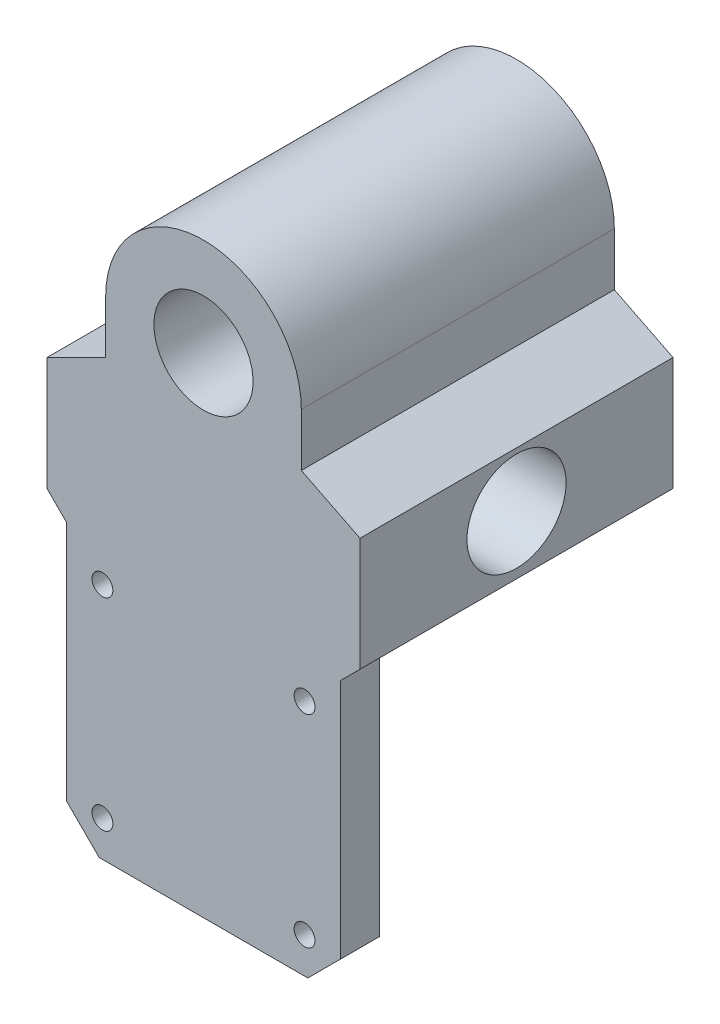
ISO-10303-21;
HEADER;
FILE_DESCRIPTION(('STEP AP214'),'2;1');
FILE_NAME('part.step','',(''),(''),'','','');
FILE_SCHEMA(('AUTOMOTIVE_DESIGN { 1 0 10303 214 1 1 1 1 }'));
ENDSEC;
DATA;
#1=APPLICATION_CONTEXT('core data for automotive mechanical design processes');
#2=APPLICATION_PROTOCOL_DEFINITION('international standard','automotive_design',2000,#1);
#3=PRODUCT_CONTEXT('',#1,'mechanical');
#4=PRODUCT('Part','Part','',(#3));
#5=PRODUCT_RELATED_PRODUCT_CATEGORY('part','',(#4));
#6=PRODUCT_DEFINITION_FORMATION('','',#4);
#7=PRODUCT_DEFINITION_CONTEXT('part definition',#1,'design');
#8=PRODUCT_DEFINITION('design','',#6,#7);
#9=PRODUCT_DEFINITION_SHAPE('','',#8);
#10=(LENGTH_UNIT() NAMED_UNIT(*) SI_UNIT(.MILLI.,.METRE.));
#11=(NAMED_UNIT(*) PLANE_ANGLE_UNIT() SI_UNIT($,.RADIAN.));
#12=(NAMED_UNIT(*) SI_UNIT($,.STERADIAN.) SOLID_ANGLE_UNIT());
#13=UNCERTAINTY_MEASURE_WITH_UNIT(LENGTH_MEASURE(1.E-05),#10,'distance_accuracy_value','');
#14=(GEOMETRIC_REPRESENTATION_CONTEXT(3) GLOBAL_UNCERTAINTY_ASSIGNED_CONTEXT((#13)) GLOBAL_UNIT_ASSIGNED_CONTEXT((#10,
#11,#12)) REPRESENTATION_CONTEXT('',''));
#15=CARTESIAN_POINT('',(0.,0.,0.));
#16=DIRECTION('',(0.,0.,1.));
#17=DIRECTION('',(1.,0.,0.));
#18=AXIS2_PLACEMENT_3D('',#15,#16,#17);
#19=CARTESIAN_POINT('',(-24.,-5.,-24.));
#20=DIRECTION('',(0.,0.,-1.));
#21=DIRECTION('',(-1.,0.,0.));
#22=AXIS2_PLACEMENT_3D('',#19,#20,#21);
#23=PLANE('',#22);
#24=CARTESIAN_POINT('',(0.,28.,-24.));
#25=DIRECTION('',(0.,0.,1.));
#26=DIRECTION('',(1.,0.,0.));
#27=AXIS2_PLACEMENT_3D('',#24,#25,#26);
#28=CIRCLE('',#27,7.6);
#29=CARTESIAN_POINT('',(7.60000000000001,28.,-24.));
#30=VERTEX_POINT('',#29);
#31=EDGE_CURVE('E230',#30,#30,#28,.T.);
#32=ORIENTED_EDGE('',*,*,#31,.T.);
#33=EDGE_LOOP('',(#32));
#34=FACE_BOUND('',#33,.T.);
#35=DIRECTION('',(-1.,0.,0.));
#36=VECTOR('',#35,1.);
#37=CARTESIAN_POINT('',(-24.,-5.,-24.));
#38=LINE('',#37,#36);
#39=CARTESIAN_POINT('',(21.,-5.,-24.));
#40=VERTEX_POINT('',#39);
#41=CARTESIAN_POINT('',(-21.,-5.,-24.));
#42=VERTEX_POINT('',#41);
#43=EDGE_CURVE('E233',#40,#42,#38,.T.);
#44=ORIENTED_EDGE('',*,*,#43,.T.);
#45=DIRECTION('',(0.707106781186549,-0.707106781186546,0.));
#46=VECTOR('',#45,1.);
#47=CARTESIAN_POINT('',(-22.5,-3.49999999999999,-24.));
#48=LINE('',#47,#46);
#49=CARTESIAN_POINT('',(-24.,-2.,-24.));
#50=VERTEX_POINT('',#49);
#51=EDGE_CURVE('E280',#42,#50,#48,.F.);
#52=ORIENTED_EDGE('',*,*,#51,.T.);
#53=DIRECTION('',(0.,1.,0.));
#54=VECTOR('',#53,1.);
#55=CARTESIAN_POINT('',(-24.,-5.,-24.));
#56=LINE('',#55,#54);
#57=CARTESIAN_POINT('',(-24.,15.4,-24.));
#58=VERTEX_POINT('',#57);
#59=EDGE_CURVE('E239',#50,#58,#56,.T.);
#60=ORIENTED_EDGE('',*,*,#59,.T.);
#61=DIRECTION('',(0.894427190999916,0.447213595499958,0.));
#62=VECTOR('',#61,1.);
#63=CARTESIAN_POINT('',(-32.16,11.32,-24.));
#64=LINE('',#63,#62);
#65=CARTESIAN_POINT('',(-15.,19.9,-24.));
#66=VERTEX_POINT('',#65);
#67=EDGE_CURVE('E260',#58,#66,#64,.T.);
#68=ORIENTED_EDGE('',*,*,#67,.T.);
#69=DIRECTION('',(0.,-1.,0.));
#70=VECTOR('',#69,1.);
#71=CARTESIAN_POINT('',(-15.,0.,-24.));
#72=LINE('',#71,#70);
#73=CARTESIAN_POINT('',(-15.,28.,-24.));
#74=VERTEX_POINT('',#73);
#75=EDGE_CURVE('E169',#74,#66,#72,.T.);
#76=ORIENTED_EDGE('',*,*,#75,.F.);
#77=CARTESIAN_POINT('',(0.,28.,-24.));
#78=DIRECTION('',(0.,0.,-1.));
#79=DIRECTION('',(-1.,0.,0.));
#80=AXIS2_PLACEMENT_3D('',#77,#78,#79);
#81=CIRCLE('',#80,15.);
#82=CARTESIAN_POINT('',(15.,28.,-24.));
#83=VERTEX_POINT('',#82);
#84=EDGE_CURVE('E148',#74,#83,#81,.T.);
#85=ORIENTED_EDGE('',*,*,#84,.T.);
#86=DIRECTION('',(0.,-1.,0.));
#87=VECTOR('',#86,1.);
#88=CARTESIAN_POINT('',(15.,0.,-24.));
#89=LINE('',#88,#87);
#90=CARTESIAN_POINT('',(15.,19.9,-24.));
#91=VERTEX_POINT('',#90);
#92=EDGE_CURVE('E167',#83,#91,#89,.T.);
#93=ORIENTED_EDGE('',*,*,#92,.T.);
#94=DIRECTION('',(-0.894427190999916,0.447213595499958,0.));
#95=VECTOR('',#94,1.);
#96=CARTESIAN_POINT('',(-6.24,30.52,-24.));
#97=LINE('',#96,#95);
#98=CARTESIAN_POINT('',(24.,15.4,-24.));
#99=VERTEX_POINT('',#98);
#100=EDGE_CURVE('E241',#91,#99,#97,.F.);
#101=ORIENTED_EDGE('',*,*,#100,.T.);
#102=DIRECTION('',(0.,1.,0.));
#103=VECTOR('',#102,1.);
#104=CARTESIAN_POINT('',(24.,-5.,-24.));
#105=LINE('',#104,#103);
#106=CARTESIAN_POINT('',(24.,-2.,-24.));
#107=VERTEX_POINT('',#106);
#108=EDGE_CURVE('E242',#107,#99,#105,.T.);
#109=ORIENTED_EDGE('',*,*,#108,.F.);
#110=DIRECTION('',(0.707106781186549,0.707106781186546,0.));
#111=VECTOR('',#110,1.);
#112=CARTESIAN_POINT('',(-1.50000000000011,-27.5,-24.));
#113=LINE('',#112,#111);
#114=EDGE_CURVE('E278',#107,#40,#113,.F.);
#115=ORIENTED_EDGE('',*,*,#114,.T.);
#116=EDGE_LOOP('',(#44,#52,#60,#68,#76,#85,#93,#101,#109,#115));
#117=FACE_BOUND('',#116,.T.);
#118=ADVANCED_FACE('F34',(#34,#117),#23,.T.);
#119=CARTESIAN_POINT('',(24.,-5.,24.));
#120=DIRECTION('',(1.,0.,0.));
#121=DIRECTION('',(0.,0.,-1.));
#122=AXIS2_PLACEMENT_3D('',#119,#120,#121);
#123=PLANE('',#122);
#124=CARTESIAN_POINT('',(24.,7.,0.));
#125=DIRECTION('',(1.,0.,0.));
#126=DIRECTION('',(0.,0.,-1.));
#127=AXIS2_PLACEMENT_3D('',#124,#125,#126);
#128=CIRCLE('',#127,7.6);
#129=CARTESIAN_POINT('',(24.,7.,-7.60000000000001));
#130=VERTEX_POINT('',#129);
#131=EDGE_CURVE('E221',#130,#130,#128,.T.);
#132=ORIENTED_EDGE('',*,*,#131,.F.);
#133=EDGE_LOOP('',(#132));
#134=FACE_BOUND('',#133,.T.);
#135=DIRECTION('',(0.,1.,0.));
#136=VECTOR('',#135,1.);
#137=CARTESIAN_POINT('',(24.,-5.,24.));
#138=LINE('',#137,#136);
#139=CARTESIAN_POINT('',(24.,-2.,24.));
#140=VERTEX_POINT('',#139);
#141=CARTESIAN_POINT('',(24.,15.4,24.));
#142=VERTEX_POINT('',#141);
#143=EDGE_CURVE('E244',#140,#142,#138,.T.);
#144=ORIENTED_EDGE('',*,*,#143,.F.);
#145=DIRECTION('',(0.,0.,-1.));
#146=VECTOR('',#145,1.);
#147=CARTESIAN_POINT('',(24.,-2.,24.));
#148=LINE('',#147,#146);
#149=EDGE_CURVE('E282',#140,#107,#148,.T.);
#150=ORIENTED_EDGE('',*,*,#149,.T.);
#151=ORIENTED_EDGE('',*,*,#108,.T.);
#152=DIRECTION('',(0.,0.,1.));
#153=VECTOR('',#152,1.);
#154=CARTESIAN_POINT('',(24.,15.4,24.));
#155=LINE('',#154,#153);
#156=EDGE_CURVE('E249',#99,#142,#155,.T.);
#157=ORIENTED_EDGE('',*,*,#156,.T.);
#158=EDGE_LOOP('',(#144,#150,#151,#157));
#159=FACE_BOUND('',#158,.T.);
#160=ADVANCED_FACE('F323',(#134,#159),#123,.T.);
#161=CARTESIAN_POINT('',(-24.,-5.,24.));
#162=DIRECTION('',(0.,0.,1.));
#163=DIRECTION('',(1.,0.,0.));
#164=AXIS2_PLACEMENT_3D('',#161,#162,#163);
#165=PLANE('',#164);
#166=CARTESIAN_POINT('',(15.5,-41.5,24.));
#167=DIRECTION('',(0.,0.,-1.));
#168=DIRECTION('',(-1.,0.,0.));
#169=AXIS2_PLACEMENT_3D('',#166,#167,#168);
#170=CIRCLE('',#169,1.6);
#171=CARTESIAN_POINT('',(13.9,-41.5,24.));
#172=VERTEX_POINT('',#171);
#173=EDGE_CURVE('E177',#172,#172,#170,.T.);
#174=ORIENTED_EDGE('',*,*,#173,.T.);
#175=EDGE_LOOP('',(#174));
#176=FACE_BOUND('',#175,.T.);
#177=CARTESIAN_POINT('',(-15.5,-41.5,24.));
#178=DIRECTION('',(0.,0.,-1.));
#179=DIRECTION('',(-1.,0.,0.));
#180=AXIS2_PLACEMENT_3D('',#177,#178,#179);
#181=CIRCLE('',#180,1.6);
#182=CARTESIAN_POINT('',(-17.1,-41.5,24.));
#183=VERTEX_POINT('',#182);
#184=EDGE_CURVE('E184',#183,#183,#181,.T.);
#185=ORIENTED_EDGE('',*,*,#184,.T.);
#186=EDGE_LOOP('',(#185));
#187=FACE_BOUND('',#186,.T.);
#188=CARTESIAN_POINT('',(-15.5,-10.5,24.));
#189=DIRECTION('',(0.,0.,-1.));
#190=DIRECTION('',(-1.,0.,0.));
#191=AXIS2_PLACEMENT_3D('',#188,#189,#190);
#192=CIRCLE('',#191,1.6);
#193=CARTESIAN_POINT('',(-17.1,-10.5,24.));
#194=VERTEX_POINT('',#193);
#195=EDGE_CURVE('E190',#194,#194,#192,.T.);
#196=ORIENTED_EDGE('',*,*,#195,.T.);
#197=EDGE_LOOP('',(#196));
#198=FACE_BOUND('',#197,.T.);
#199=CARTESIAN_POINT('',(15.5,-10.5,24.));
#200=DIRECTION('',(0.,0.,-1.));
#201=DIRECTION('',(-1.,0.,0.));
#202=AXIS2_PLACEMENT_3D('',#199,#200,#201);
#203=CIRCLE('',#202,1.6);
#204=CARTESIAN_POINT('',(13.9,-10.5,24.));
#205=VERTEX_POINT('',#204);
#206=EDGE_CURVE('E195',#205,#205,#203,.T.);
#207=ORIENTED_EDGE('',*,*,#206,.T.);
#208=EDGE_LOOP('',(#207));
#209=FACE_BOUND('',#208,.T.);
#210=CARTESIAN_POINT('',(0.,28.,24.));
#211=DIRECTION('',(0.,0.,1.));
#212=DIRECTION('',(1.,0.,0.));
#213=AXIS2_PLACEMENT_3D('',#210,#211,#212);
#214=CIRCLE('',#213,7.6);
#215=CARTESIAN_POINT('',(7.60000000000001,28.,24.));
#216=VERTEX_POINT('',#215);
#217=EDGE_CURVE('E227',#216,#216,#214,.T.);
#218=ORIENTED_EDGE('',*,*,#217,.F.);
#219=EDGE_LOOP('',(#218));
#220=FACE_BOUND('',#219,.T.);
#221=DIRECTION('',(0.,-1.,0.));
#222=VECTOR('',#221,1.);
#223=CARTESIAN_POINT('',(-21.,-5.,24.));
#224=LINE('',#223,#222);
#225=CARTESIAN_POINT('',(-21.,-5.,24.));
#226=VERTEX_POINT('',#225);
#227=CARTESIAN_POINT('',(-21.,-42.,24.));
#228=VERTEX_POINT('',#227);
#229=EDGE_CURVE('E198',#226,#228,#224,.T.);
#230=ORIENTED_EDGE('',*,*,#229,.T.);
#231=DIRECTION('',(-0.707106781186549,0.707106781186546,0.));
#232=VECTOR('',#231,1.);
#233=CARTESIAN_POINT('',(-41.,-22.0000000000001,24.));
#234=LINE('',#233,#232);
#235=CARTESIAN_POINT('',(-16.,-47.,24.));
#236=VERTEX_POINT('',#235);
#237=EDGE_CURVE('E290',#228,#236,#234,.F.);
#238=ORIENTED_EDGE('',*,*,#237,.T.);
#239=DIRECTION('',(1.,0.,0.));
#240=VECTOR('',#239,1.);
#241=CARTESIAN_POINT('',(-21.,-47.,24.));
#242=LINE('',#241,#240);
#243=CARTESIAN_POINT('',(16.,-47.,24.));
#244=VERTEX_POINT('',#243);
#245=EDGE_CURVE('E214',#236,#244,#242,.T.);
#246=ORIENTED_EDGE('',*,*,#245,.T.);
#247=DIRECTION('',(-0.707106781186547,-0.707106781186549,0.));
#248=VECTOR('',#247,1.);
#249=CARTESIAN_POINT('',(17.,-45.9999999999999,24.));
#250=LINE('',#249,#248);
#251=CARTESIAN_POINT('',(21.,-42.,24.));
#252=VERTEX_POINT('',#251);
#253=EDGE_CURVE('E288',#244,#252,#250,.F.);
#254=ORIENTED_EDGE('',*,*,#253,.T.);
#255=DIRECTION('',(0.,1.,0.));
#256=VECTOR('',#255,1.);
#257=CARTESIAN_POINT('',(21.,-5.,24.));
#258=LINE('',#257,#256);
#259=CARTESIAN_POINT('',(21.,-5.,24.));
#260=VERTEX_POINT('',#259);
#261=EDGE_CURVE('E205',#252,#260,#258,.T.);
#262=ORIENTED_EDGE('',*,*,#261,.T.);
#263=DIRECTION('',(-0.707106781186549,-0.707106781186546,0.));
#264=VECTOR('',#263,1.);
#265=CARTESIAN_POINT('',(-1.50000000000011,-27.5,24.));
#266=LINE('',#265,#264);
#267=EDGE_CURVE('E269',#260,#140,#266,.F.);
#268=ORIENTED_EDGE('',*,*,#267,.T.);
#269=ORIENTED_EDGE('',*,*,#143,.T.);
#270=DIRECTION('',(0.894427190999916,-0.447213595499958,0.));
#271=VECTOR('',#270,1.);
#272=CARTESIAN_POINT('',(-6.24,30.52,24.));
#273=LINE('',#272,#271);
#274=CARTESIAN_POINT('',(15.,19.9,24.));
#275=VERTEX_POINT('',#274);
#276=EDGE_CURVE('E252',#142,#275,#273,.F.);
#277=ORIENTED_EDGE('',*,*,#276,.T.);
#278=DIRECTION('',(0.,-1.,0.));
#279=VECTOR('',#278,1.);
#280=CARTESIAN_POINT('',(15.,0.,24.));
#281=LINE('',#280,#279);
#282=CARTESIAN_POINT('',(15.,28.,24.));
#283=VERTEX_POINT('',#282);
#284=EDGE_CURVE('E152',#283,#275,#281,.T.);
#285=ORIENTED_EDGE('',*,*,#284,.F.);
#286=CARTESIAN_POINT('',(0.,28.,24.));
#287=DIRECTION('',(0.,0.,-1.));
#288=DIRECTION('',(-1.,0.,0.));
#289=AXIS2_PLACEMENT_3D('',#286,#287,#288);
#290=CIRCLE('',#289,15.);
#291=CARTESIAN_POINT('',(-15.,28.,24.));
#292=VERTEX_POINT('',#291);
#293=EDGE_CURVE('E145',#292,#283,#290,.T.);
#294=ORIENTED_EDGE('',*,*,#293,.F.);
#295=DIRECTION('',(0.,-1.,0.));
#296=VECTOR('',#295,1.);
#297=CARTESIAN_POINT('',(-15.,0.,24.));
#298=LINE('',#297,#296);
#299=CARTESIAN_POINT('',(-15.,19.9,24.));
#300=VERTEX_POINT('',#299);
#301=EDGE_CURVE('E155',#292,#300,#298,.T.);
#302=ORIENTED_EDGE('',*,*,#301,.T.);
#303=DIRECTION('',(-0.894427190999916,-0.447213595499958,0.));
#304=VECTOR('',#303,1.);
#305=CARTESIAN_POINT('',(-32.16,11.32,24.));
#306=LINE('',#305,#304);
#307=CARTESIAN_POINT('',(-24.,15.4,24.));
#308=VERTEX_POINT('',#307);
#309=EDGE_CURVE('E263',#300,#308,#306,.T.);
#310=ORIENTED_EDGE('',*,*,#309,.T.);
#311=DIRECTION('',(0.,1.,0.));
#312=VECTOR('',#311,1.);
#313=CARTESIAN_POINT('',(-24.,-5.,24.));
#314=LINE('',#313,#312);
#315=CARTESIAN_POINT('',(-24.,-2.,24.));
#316=VERTEX_POINT('',#315);
#317=EDGE_CURVE('E238',#316,#308,#314,.T.);
#318=ORIENTED_EDGE('',*,*,#317,.F.);
#319=DIRECTION('',(-0.707106781186549,0.707106781186546,0.));
#320=VECTOR('',#319,1.);
#321=CARTESIAN_POINT('',(-22.5,-3.49999999999999,24.));
#322=LINE('',#321,#320);
#323=EDGE_CURVE('E271',#316,#226,#322,.F.);
#324=ORIENTED_EDGE('',*,*,#323,.T.);
#325=EDGE_LOOP('',(#230,#238,#246,#254,#262,#268,#269,#277,#285,#294,#302,#310,#318,#324));
#326=FACE_BOUND('',#325,.T.);
#327=ADVANCED_FACE('F165',(#176,#187,#198,#209,#220,#326),#165,.T.);
#328=CARTESIAN_POINT('',(-24.,-5.,24.));
#329=DIRECTION('',(-1.,0.,0.));
#330=DIRECTION('',(0.,0.,1.));
#331=AXIS2_PLACEMENT_3D('',#328,#329,#330);
#332=PLANE('',#331);
#333=ORIENTED_EDGE('',*,*,#59,.F.);
#334=DIRECTION('',(0.,0.,1.));
#335=VECTOR('',#334,1.);
#336=CARTESIAN_POINT('',(-24.,-2.,24.));
#337=LINE('',#336,#335);
#338=EDGE_CURVE('E266',#50,#316,#337,.T.);
#339=ORIENTED_EDGE('',*,*,#338,.T.);
#340=ORIENTED_EDGE('',*,*,#317,.T.);
#341=DIRECTION('',(0.,0.,-1.));
#342=VECTOR('',#341,1.);
#343=CARTESIAN_POINT('',(-24.,15.4,-24.));
#344=LINE('',#343,#342);
#345=EDGE_CURVE('E257',#308,#58,#344,.T.);
#346=ORIENTED_EDGE('',*,*,#345,.T.);
#347=EDGE_LOOP('',(#333,#339,#340,#346));
#348=FACE_BOUND('',#347,.T.);
#349=CARTESIAN_POINT('',(-24.,7.,0.));
#350=DIRECTION('',(1.,0.,0.));
#351=DIRECTION('',(0.,0.,-1.));
#352=AXIS2_PLACEMENT_3D('',#349,#350,#351);
#353=CIRCLE('',#352,7.6);
#354=CARTESIAN_POINT('',(-24.,7.,-7.60000000000001));
#355=VERTEX_POINT('',#354);
#356=EDGE_CURVE('E224',#355,#355,#353,.T.);
#357=ORIENTED_EDGE('',*,*,#356,.T.);
#358=EDGE_LOOP('',(#357));
#359=FACE_BOUND('',#358,.T.);
#360=ADVANCED_FACE('F340',(#348,#359),#332,.T.);
#361=CARTESIAN_POINT('',(0.,-5.,0.));
#362=DIRECTION('',(0.,-1.,0.));
#363=DIRECTION('',(0.,0.,-1.));
#364=AXIS2_PLACEMENT_3D('',#361,#362,#363);
#365=PLANE('',#364);
#366=DIRECTION('',(-1.,0.,0.));
#367=VECTOR('',#366,1.);
#368=CARTESIAN_POINT('',(-21.,-5.,18.));
#369=LINE('',#368,#367);
#370=CARTESIAN_POINT('',(21.,-5.,18.));
#371=VERTEX_POINT('',#370);
#372=CARTESIAN_POINT('',(-21.,-5.,18.));
#373=VERTEX_POINT('',#372);
#374=EDGE_CURVE('E209',#371,#373,#369,.T.);
#375=ORIENTED_EDGE('',*,*,#374,.T.);
#376=DIRECTION('',(0.,0.,-1.));
#377=VECTOR('',#376,1.);
#378=CARTESIAN_POINT('',(-21.,-5.,0.));
#379=LINE('',#378,#377);
#380=EDGE_CURVE('E276',#373,#42,#379,.T.);
#381=ORIENTED_EDGE('',*,*,#380,.T.);
#382=ORIENTED_EDGE('',*,*,#43,.F.);
#383=DIRECTION('',(0.,0.,1.));
#384=VECTOR('',#383,1.);
#385=CARTESIAN_POINT('',(21.,-5.,0.));
#386=LINE('',#385,#384);
#387=EDGE_CURVE('E273',#40,#371,#386,.T.);
#388=ORIENTED_EDGE('',*,*,#387,.T.);
#389=EDGE_LOOP('',(#375,#381,#382,#388));
#390=FACE_BOUND('',#389,.T.);
#391=ADVANCED_FACE('F349',(#390),#365,.T.);
#392=CARTESIAN_POINT('',(0.,28.,-24.));
#393=DIRECTION('',(0.,0.,1.));
#394=DIRECTION('',(1.,0.,0.));
#395=AXIS2_PLACEMENT_3D('',#392,#393,#394);
#396=CYLINDRICAL_SURFACE('',#395,7.6);
#397=ORIENTED_EDGE('',*,*,#31,.F.);
#398=EDGE_LOOP('',(#397));
#399=FACE_BOUND('',#398,.T.);
#400=ORIENTED_EDGE('',*,*,#217,.T.);
#401=EDGE_LOOP('',(#400));
#402=FACE_BOUND('',#401,.T.);
#403=ADVANCED_FACE('F351',(#399,#402),#396,.F.);
#404=CARTESIAN_POINT('',(-24.,7.,0.));
#405=DIRECTION('',(1.,0.,0.));
#406=DIRECTION('',(0.,0.,-1.));
#407=AXIS2_PLACEMENT_3D('',#404,#405,#406);
#408=CYLINDRICAL_SURFACE('',#407,7.6);
#409=ORIENTED_EDGE('',*,*,#356,.F.);
#410=EDGE_LOOP('',(#409));
#411=FACE_BOUND('',#410,.T.);
#412=ORIENTED_EDGE('',*,*,#131,.T.);
#413=EDGE_LOOP('',(#412));
#414=FACE_BOUND('',#413,.T.);
#415=ADVANCED_FACE('F357',(#411,#414),#408,.F.);
#416=CARTESIAN_POINT('',(-21.,-5.,18.));
#417=DIRECTION('',(-1.,0.,0.));
#418=DIRECTION('',(0.,-1.,0.));
#419=AXIS2_PLACEMENT_3D('',#416,#417,#418);
#420=PLANE('',#419);
#421=DIRECTION('',(0.,-1.,0.));
#422=VECTOR('',#421,1.);
#423=CARTESIAN_POINT('',(-21.,-5.,18.));
#424=LINE('',#423,#422);
#425=CARTESIAN_POINT('',(-21.,-42.,18.));
#426=VERTEX_POINT('',#425);
#427=EDGE_CURVE('E201',#373,#426,#424,.T.);
#428=ORIENTED_EDGE('',*,*,#427,.T.);
#429=DIRECTION('',(0.,0.,1.));
#430=VECTOR('',#429,1.);
#431=CARTESIAN_POINT('',(-21.,-42.,18.));
#432=LINE('',#431,#430);
#433=EDGE_CURVE('E285',#426,#228,#432,.T.);
#434=ORIENTED_EDGE('',*,*,#433,.T.);
#435=ORIENTED_EDGE('',*,*,#229,.F.);
#436=DIRECTION('',(0.,0.,1.));
#437=VECTOR('',#436,1.);
#438=CARTESIAN_POINT('',(-21.,-5.,18.));
#439=LINE('',#438,#437);
#440=EDGE_CURVE('E218',#373,#226,#439,.T.);
#441=ORIENTED_EDGE('',*,*,#440,.F.);
#442=EDGE_LOOP('',(#428,#434,#435,#441));
#443=FACE_BOUND('',#442,.T.);
#444=ADVANCED_FACE('F305',(#443),#420,.T.);
#445=CARTESIAN_POINT('',(21.,-5.,18.));
#446=DIRECTION('',(1.,0.,0.));
#447=DIRECTION('',(0.,1.,0.));
#448=AXIS2_PLACEMENT_3D('',#445,#446,#447);
#449=PLANE('',#448);
#450=ORIENTED_EDGE('',*,*,#261,.F.);
#451=DIRECTION('',(0.,0.,-1.));
#452=VECTOR('',#451,1.);
#453=CARTESIAN_POINT('',(21.,-42.,18.));
#454=LINE('',#453,#452);
#455=CARTESIAN_POINT('',(21.,-42.,18.));
#456=VERTEX_POINT('',#455);
#457=EDGE_CURVE('E11',#252,#456,#454,.T.);
#458=ORIENTED_EDGE('',*,*,#457,.T.);
#459=DIRECTION('',(0.,1.,0.));
#460=VECTOR('',#459,1.);
#461=CARTESIAN_POINT('',(21.,-5.,18.));
#462=LINE('',#461,#460);
#463=EDGE_CURVE('E207',#456,#371,#462,.T.);
#464=ORIENTED_EDGE('',*,*,#463,.T.);
#465=DIRECTION('',(0.,0.,1.));
#466=VECTOR('',#465,1.);
#467=CARTESIAN_POINT('',(21.,-5.,18.));
#468=LINE('',#467,#466);
#469=EDGE_CURVE('E212',#371,#260,#468,.T.);
#470=ORIENTED_EDGE('',*,*,#469,.T.);
#471=EDGE_LOOP('',(#450,#458,#464,#470));
#472=FACE_BOUND('',#471,.T.);
#473=ADVANCED_FACE('F313',(#472),#449,.T.);
#474=CARTESIAN_POINT('',(-21.,-47.,18.));
#475=DIRECTION('',(0.,-1.,0.));
#476=DIRECTION('',(0.,0.,-1.));
#477=AXIS2_PLACEMENT_3D('',#474,#475,#476);
#478=PLANE('',#477);
#479=ORIENTED_EDGE('',*,*,#245,.F.);
#480=DIRECTION('',(0.,0.,-1.));
#481=VECTOR('',#480,1.);
#482=CARTESIAN_POINT('',(-16.,-47.,18.));
#483=LINE('',#482,#481);
#484=CARTESIAN_POINT('',(-16.,-47.,18.));
#485=VERTEX_POINT('',#484);
#486=EDGE_CURVE('E295',#236,#485,#483,.T.);
#487=ORIENTED_EDGE('',*,*,#486,.T.);
#488=DIRECTION('',(1.,0.,0.));
#489=VECTOR('',#488,1.);
#490=CARTESIAN_POINT('',(-21.,-47.,18.));
#491=LINE('',#490,#489);
#492=CARTESIAN_POINT('',(16.,-47.,18.));
#493=VERTEX_POINT('',#492);
#494=EDGE_CURVE('E204',#485,#493,#491,.T.);
#495=ORIENTED_EDGE('',*,*,#494,.T.);
#496=DIRECTION('',(0.,0.,1.));
#497=VECTOR('',#496,1.);
#498=CARTESIAN_POINT('',(16.,-47.,18.));
#499=LINE('',#498,#497);
#500=EDGE_CURVE('E292',#493,#244,#499,.T.);
#501=ORIENTED_EDGE('',*,*,#500,.T.);
#502=EDGE_LOOP('',(#479,#487,#495,#501));
#503=FACE_BOUND('',#502,.T.);
#504=ADVANCED_FACE('F310',(#503),#478,.T.);
#505=CARTESIAN_POINT('',(0.,0.,18.));
#506=DIRECTION('',(0.,0.,1.));
#507=DIRECTION('',(1.,0.,0.));
#508=AXIS2_PLACEMENT_3D('',#505,#506,#507);
#509=PLANE('',#508);
#510=CARTESIAN_POINT('',(15.5,-41.5,18.));
#511=DIRECTION('',(0.,0.,-1.));
#512=DIRECTION('',(-1.,0.,0.));
#513=AXIS2_PLACEMENT_3D('',#510,#511,#512);
#514=CIRCLE('',#513,1.6);
#515=CARTESIAN_POINT('',(13.9,-41.5,18.));
#516=VERTEX_POINT('',#515);
#517=EDGE_CURVE('E181',#516,#516,#514,.T.);
#518=ORIENTED_EDGE('',*,*,#517,.F.);
#519=EDGE_LOOP('',(#518));
#520=FACE_BOUND('',#519,.T.);
#521=CARTESIAN_POINT('',(-15.5,-41.5,18.));
#522=DIRECTION('',(0.,0.,-1.));
#523=DIRECTION('',(-1.,0.,0.));
#524=AXIS2_PLACEMENT_3D('',#521,#522,#523);
#525=CIRCLE('',#524,1.6);
#526=CARTESIAN_POINT('',(-17.1,-41.5,18.));
#527=VERTEX_POINT('',#526);
#528=EDGE_CURVE('E187',#527,#527,#525,.T.);
#529=ORIENTED_EDGE('',*,*,#528,.F.);
#530=EDGE_LOOP('',(#529));
#531=FACE_BOUND('',#530,.T.);
#532=CARTESIAN_POINT('',(-15.5,-10.5,18.));
#533=DIRECTION('',(0.,0.,-1.));
#534=DIRECTION('',(-1.,0.,0.));
#535=AXIS2_PLACEMENT_3D('',#532,#533,#534);
#536=CIRCLE('',#535,1.6);
#537=CARTESIAN_POINT('',(-17.1,-10.5,18.));
#538=VERTEX_POINT('',#537);
#539=EDGE_CURVE('E175',#538,#538,#536,.T.);
#540=ORIENTED_EDGE('',*,*,#539,.F.);
#541=EDGE_LOOP('',(#540));
#542=FACE_BOUND('',#541,.T.);
#543=CARTESIAN_POINT('',(15.5,-10.5,18.));
#544=DIRECTION('',(0.,0.,-1.));
#545=DIRECTION('',(-1.,0.,0.));
#546=AXIS2_PLACEMENT_3D('',#543,#544,#545);
#547=CIRCLE('',#546,1.6);
#548=CARTESIAN_POINT('',(13.9,-10.5,18.));
#549=VERTEX_POINT('',#548);
#550=EDGE_CURVE('E180',#549,#549,#547,.T.);
#551=ORIENTED_EDGE('',*,*,#550,.F.);
#552=EDGE_LOOP('',(#551));
#553=FACE_BOUND('',#552,.T.);
#554=ORIENTED_EDGE('',*,*,#494,.F.);
#555=DIRECTION('',(0.707106781186549,-0.707106781186546,0.));
#556=VECTOR('',#555,1.);
#557=CARTESIAN_POINT('',(-21.,-42.,18.));
#558=LINE('',#557,#556);
#559=EDGE_CURVE('E42',#485,#426,#558,.F.);
#560=ORIENTED_EDGE('',*,*,#559,.T.);
#561=ORIENTED_EDGE('',*,*,#427,.F.);
#562=ORIENTED_EDGE('',*,*,#374,.F.);
#563=ORIENTED_EDGE('',*,*,#463,.F.);
#564=DIRECTION('',(0.707106781186547,0.707106781186549,0.));
#565=VECTOR('',#564,1.);
#566=CARTESIAN_POINT('',(16.,-47.,18.));
#567=LINE('',#566,#565);
#568=EDGE_CURVE('E54',#456,#493,#567,.F.);
#569=ORIENTED_EDGE('',*,*,#568,.T.);
#570=EDGE_LOOP('',(#554,#560,#561,#562,#563,#569));
#571=FACE_BOUND('',#570,.T.);
#572=ADVANCED_FACE('F299',(#520,#531,#542,#553,#571),#509,.F.);
#573=CARTESIAN_POINT('',(15.5,-10.5,24.));
#574=DIRECTION('',(0.,0.,-1.));
#575=DIRECTION('',(-1.,0.,0.));
#576=AXIS2_PLACEMENT_3D('',#573,#574,#575);
#577=CYLINDRICAL_SURFACE('',#576,1.6);
#578=ORIENTED_EDGE('',*,*,#206,.F.);
#579=EDGE_LOOP('',(#578));
#580=FACE_BOUND('',#579,.T.);
#581=ORIENTED_EDGE('',*,*,#550,.T.);
#582=EDGE_LOOP('',(#581));
#583=FACE_BOUND('',#582,.T.);
#584=ADVANCED_FACE('F400',(#580,#583),#577,.F.);
#585=CARTESIAN_POINT('',(-15.5,-10.5,24.));
#586=DIRECTION('',(0.,0.,-1.));
#587=DIRECTION('',(-1.,0.,0.));
#588=AXIS2_PLACEMENT_3D('',#585,#586,#587);
#589=CYLINDRICAL_SURFACE('',#588,1.6);
#590=ORIENTED_EDGE('',*,*,#195,.F.);
#591=EDGE_LOOP('',(#590));
#592=FACE_BOUND('',#591,.T.);
#593=ORIENTED_EDGE('',*,*,#539,.T.);
#594=EDGE_LOOP('',(#593));
#595=FACE_BOUND('',#594,.T.);
#596=ADVANCED_FACE('F524',(#592,#595),#589,.F.);
#597=CARTESIAN_POINT('',(-15.5,-41.5,24.));
#598=DIRECTION('',(0.,0.,-1.));
#599=DIRECTION('',(-1.,0.,0.));
#600=AXIS2_PLACEMENT_3D('',#597,#598,#599);
#601=CYLINDRICAL_SURFACE('',#600,1.6);
#602=ORIENTED_EDGE('',*,*,#184,.F.);
#603=EDGE_LOOP('',(#602));
#604=FACE_BOUND('',#603,.T.);
#605=ORIENTED_EDGE('',*,*,#528,.T.);
#606=EDGE_LOOP('',(#605));
#607=FACE_BOUND('',#606,.T.);
#608=ADVANCED_FACE('F514',(#604,#607),#601,.F.);
#609=CARTESIAN_POINT('',(15.5,-41.5,24.));
#610=DIRECTION('',(0.,0.,-1.));
#611=DIRECTION('',(-1.,0.,0.));
#612=AXIS2_PLACEMENT_3D('',#609,#610,#611);
#613=CYLINDRICAL_SURFACE('',#612,1.6);
#614=ORIENTED_EDGE('',*,*,#173,.F.);
#615=EDGE_LOOP('',(#614));
#616=FACE_BOUND('',#615,.T.);
#617=ORIENTED_EDGE('',*,*,#517,.T.);
#618=EDGE_LOOP('',(#617));
#619=FACE_BOUND('',#618,.T.);
#620=ADVANCED_FACE('F505',(#616,#619),#613,.F.);
#621=CARTESIAN_POINT('',(0.,28.,24.));
#622=DIRECTION('',(0.,0.,-1.));
#623=DIRECTION('',(-1.,0.,0.));
#624=AXIS2_PLACEMENT_3D('',#621,#622,#623);
#625=CYLINDRICAL_SURFACE('',#624,15.);
#626=ORIENTED_EDGE('',*,*,#84,.F.);
#627=DIRECTION('',(0.,0.,-1.));
#628=VECTOR('',#627,1.);
#629=CARTESIAN_POINT('',(-15.,28.,24.));
#630=LINE('',#629,#628);
#631=EDGE_CURVE('E140',#292,#74,#630,.T.);
#632=ORIENTED_EDGE('',*,*,#631,.F.);
#633=ORIENTED_EDGE('',*,*,#293,.T.);
#634=DIRECTION('',(0.,0.,-1.));
#635=VECTOR('',#634,1.);
#636=CARTESIAN_POINT('',(15.,28.,24.));
#637=LINE('',#636,#635);
#638=EDGE_CURVE('E151',#283,#83,#637,.T.);
#639=ORIENTED_EDGE('',*,*,#638,.T.);
#640=EDGE_LOOP('',(#626,#632,#633,#639));
#641=FACE_BOUND('',#640,.T.);
#642=ADVANCED_FACE('F142',(#641),#625,.T.);
#643=CARTESIAN_POINT('',(15.,0.,24.));
#644=DIRECTION('',(1.,0.,0.));
#645=DIRECTION('',(0.,1.,0.));
#646=AXIS2_PLACEMENT_3D('',#643,#644,#645);
#647=PLANE('',#646);
#648=ORIENTED_EDGE('',*,*,#92,.F.);
#649=ORIENTED_EDGE('',*,*,#638,.F.);
#650=ORIENTED_EDGE('',*,*,#284,.T.);
#651=DIRECTION('',(0.,0.,1.));
#652=VECTOR('',#651,1.);
#653=CARTESIAN_POINT('',(15.,19.9,24.));
#654=LINE('',#653,#652);
#655=EDGE_CURVE('E254',#275,#91,#654,.F.);
#656=ORIENTED_EDGE('',*,*,#655,.T.);
#657=EDGE_LOOP('',(#648,#649,#650,#656));
#658=FACE_BOUND('',#657,.T.);
#659=ADVANCED_FACE('F331',(#658),#647,.T.);
#660=CARTESIAN_POINT('',(-15.,0.,24.));
#661=DIRECTION('',(1.,0.,0.));
#662=DIRECTION('',(0.,1.,0.));
#663=AXIS2_PLACEMENT_3D('',#660,#661,#662);
#664=PLANE('',#663);
#665=ORIENTED_EDGE('',*,*,#75,.T.);
#666=DIRECTION('',(0.,0.,1.));
#667=VECTOR('',#666,1.);
#668=CARTESIAN_POINT('',(-15.,19.9,24.));
#669=LINE('',#668,#667);
#670=EDGE_CURVE('E158',#66,#300,#669,.T.);
#671=ORIENTED_EDGE('',*,*,#670,.T.);
#672=ORIENTED_EDGE('',*,*,#301,.F.);
#673=ORIENTED_EDGE('',*,*,#631,.T.);
#674=EDGE_LOOP('',(#665,#671,#672,#673));
#675=FACE_BOUND('',#674,.T.);
#676=ADVANCED_FACE('F156',(#675),#664,.F.);
#677=CARTESIAN_POINT('',(14.,20.4,24.));
#678=DIRECTION('',(-0.447213595499958,-0.894427190999916,0.));
#679=DIRECTION('',(0.,0.,-1.));
#680=AXIS2_PLACEMENT_3D('',#677,#678,#679);
#681=PLANE('',#680);
#682=ORIENTED_EDGE('',*,*,#276,.F.);
#683=ORIENTED_EDGE('',*,*,#156,.F.);
#684=ORIENTED_EDGE('',*,*,#100,.F.);
#685=ORIENTED_EDGE('',*,*,#655,.F.);
#686=EDGE_LOOP('',(#682,#683,#684,#685));
#687=FACE_BOUND('',#686,.T.);
#688=ADVANCED_FACE('F328',(#687),#681,.F.);
#689=CARTESIAN_POINT('',(-24.,15.4,24.));
#690=DIRECTION('',(-0.447213595499958,0.894427190999916,0.));
#691=DIRECTION('',(0.,0.,1.));
#692=AXIS2_PLACEMENT_3D('',#689,#690,#691);
#693=PLANE('',#692);
#694=ORIENTED_EDGE('',*,*,#309,.F.);
#695=ORIENTED_EDGE('',*,*,#670,.F.);
#696=ORIENTED_EDGE('',*,*,#67,.F.);
#697=ORIENTED_EDGE('',*,*,#345,.F.);
#698=EDGE_LOOP('',(#694,#695,#696,#697));
#699=FACE_BOUND('',#698,.T.);
#700=ADVANCED_FACE('F337',(#699),#693,.T.);
#701=CARTESIAN_POINT('',(-24.,-2.,24.));
#702=DIRECTION('',(0.707106781186546,0.707106781186549,0.));
#703=DIRECTION('',(0.,0.,1.));
#704=AXIS2_PLACEMENT_3D('',#701,#702,#703);
#705=PLANE('',#704);
#706=ORIENTED_EDGE('',*,*,#380,.F.);
#707=ORIENTED_EDGE('',*,*,#440,.T.);
#708=ORIENTED_EDGE('',*,*,#323,.F.);
#709=ORIENTED_EDGE('',*,*,#338,.F.);
#710=ORIENTED_EDGE('',*,*,#51,.F.);
#711=EDGE_LOOP('',(#706,#707,#708,#709,#710));
#712=FACE_BOUND('',#711,.T.);
#713=ADVANCED_FACE('F346',(#712),#705,.F.);
#714=CARTESIAN_POINT('',(24.,-2.,24.));
#715=DIRECTION('',(-0.707106781186546,0.707106781186549,0.));
#716=DIRECTION('',(0.,0.,-1.));
#717=AXIS2_PLACEMENT_3D('',#714,#715,#716);
#718=PLANE('',#717);
#719=ORIENTED_EDGE('',*,*,#469,.F.);
#720=ORIENTED_EDGE('',*,*,#387,.F.);
#721=ORIENTED_EDGE('',*,*,#114,.F.);
#722=ORIENTED_EDGE('',*,*,#149,.F.);
#723=ORIENTED_EDGE('',*,*,#267,.F.);
#724=EDGE_LOOP('',(#719,#720,#721,#722,#723));
#725=FACE_BOUND('',#724,.T.);
#726=ADVANCED_FACE('F319',(#725),#718,.F.);
#727=CARTESIAN_POINT('',(-21.,-42.,18.));
#728=DIRECTION('',(0.707106781186545,0.707106781186549,0.));
#729=DIRECTION('',(0.,0.,1.));
#730=AXIS2_PLACEMENT_3D('',#727,#728,#729);
#731=PLANE('',#730);
#732=ORIENTED_EDGE('',*,*,#559,.F.);
#733=ORIENTED_EDGE('',*,*,#486,.F.);
#734=ORIENTED_EDGE('',*,*,#237,.F.);
#735=ORIENTED_EDGE('',*,*,#433,.F.);
#736=EDGE_LOOP('',(#732,#733,#734,#735));
#737=FACE_BOUND('',#736,.T.);
#738=ADVANCED_FACE('F307',(#737),#731,.F.);
#739=CARTESIAN_POINT('',(16.,-47.,18.));
#740=DIRECTION('',(-0.707106781186548,0.707106781186546,0.));
#741=DIRECTION('',(0.,0.,1.));
#742=AXIS2_PLACEMENT_3D('',#739,#740,#741);
#743=PLANE('',#742);
#744=ORIENTED_EDGE('',*,*,#568,.F.);
#745=ORIENTED_EDGE('',*,*,#457,.F.);
#746=ORIENTED_EDGE('',*,*,#253,.F.);
#747=ORIENTED_EDGE('',*,*,#500,.F.);
#748=EDGE_LOOP('',(#744,#745,#746,#747));
#749=FACE_BOUND('',#748,.T.);
#750=ADVANCED_FACE('F36',(#749),#743,.F.);
#751=CLOSED_SHELL('',(#118,#160,#327,#360,#391,#403,#415,#444,#473,#504,#572,#584,#596,#608,
#620,#642,#659,#676,#688,#700,#713,#726,#738,#750));
#752=MANIFOLD_SOLID_BREP('B2',#751);
#753=ADVANCED_BREP_SHAPE_REPRESENTATION('',(#18,#752),#14);
#754=SHAPE_DEFINITION_REPRESENTATION(#9,#753);
ENDSEC;
END-ISO-10303-21;
